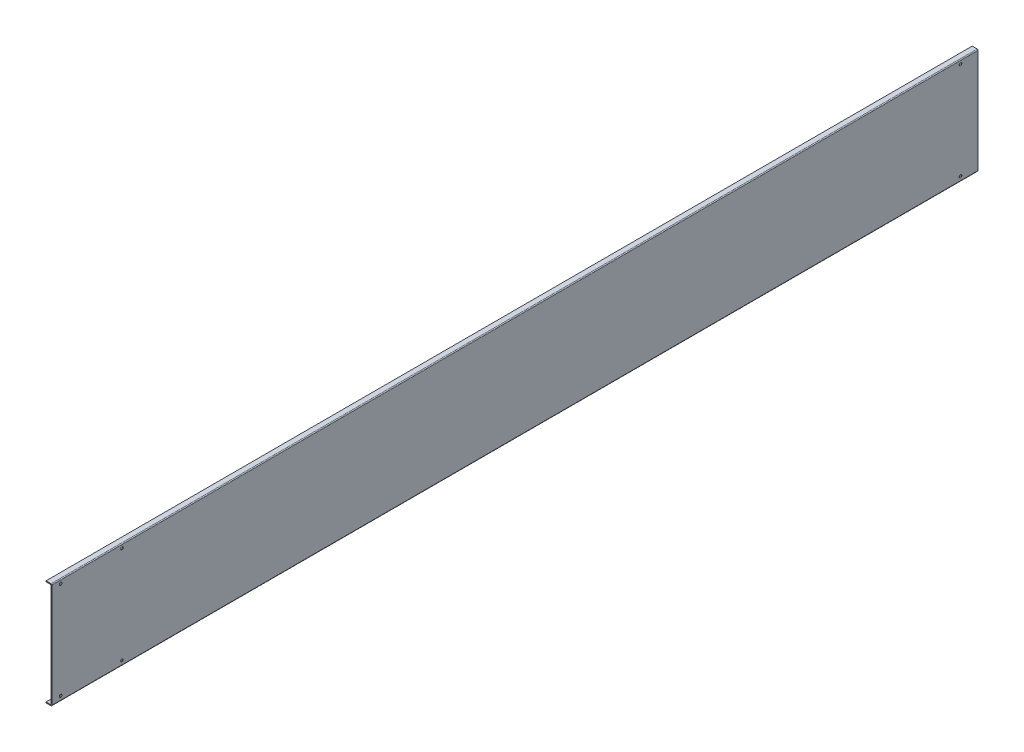
ISO-10303-21;
HEADER;
FILE_DESCRIPTION(('STEP AP214'),'2;1');
FILE_NAME('part.step','',(''),(''),'','','');
FILE_SCHEMA(('AUTOMOTIVE_DESIGN { 1 0 10303 214 1 1 1 1 }'));
ENDSEC;
DATA;
#1=APPLICATION_CONTEXT('core data for automotive mechanical design processes');
#2=APPLICATION_PROTOCOL_DEFINITION('international standard','automotive_design',2000,#1);
#3=PRODUCT_CONTEXT('',#1,'mechanical');
#4=PRODUCT('Part','Part','',(#3));
#5=PRODUCT_RELATED_PRODUCT_CATEGORY('part','',(#4));
#6=PRODUCT_DEFINITION_FORMATION('','',#4);
#7=PRODUCT_DEFINITION_CONTEXT('part definition',#1,'design');
#8=PRODUCT_DEFINITION('design','',#6,#7);
#9=PRODUCT_DEFINITION_SHAPE('','',#8);
#10=(LENGTH_UNIT() NAMED_UNIT(*) SI_UNIT(.MILLI.,.METRE.));
#11=(NAMED_UNIT(*) PLANE_ANGLE_UNIT() SI_UNIT($,.RADIAN.));
#12=(NAMED_UNIT(*) SI_UNIT($,.STERADIAN.) SOLID_ANGLE_UNIT());
#13=UNCERTAINTY_MEASURE_WITH_UNIT(LENGTH_MEASURE(1.E-05),#10,'distance_accuracy_value','');
#14=(GEOMETRIC_REPRESENTATION_CONTEXT(3) GLOBAL_UNCERTAINTY_ASSIGNED_CONTEXT((#13)) GLOBAL_UNIT_ASSIGNED_CONTEXT((#10,
#11,#12)) REPRESENTATION_CONTEXT('',''));
#15=CARTESIAN_POINT('',(0.,0.,0.));
#16=DIRECTION('',(0.,0.,1.));
#17=DIRECTION('',(1.,0.,0.));
#18=AXIS2_PLACEMENT_3D('',#15,#16,#17);
#19=CARTESIAN_POINT('',(0.,-181.,-1585.));
#20=DIRECTION('',(1.,0.,0.));
#21=DIRECTION('',(0.,0.,-1.));
#22=AXIS2_PLACEMENT_3D('',#19,#20,#21);
#23=PLANE('',#22);
#24=CARTESIAN_POINT('',(0.,-173.,-120.));
#25=DIRECTION('',(1.,0.,0.));
#26=DIRECTION('',(0.,0.,-1.));
#27=AXIS2_PLACEMENT_3D('',#24,#25,#26);
#28=CIRCLE('',#27,2.25);
#29=CARTESIAN_POINT('',(0.,-173.,-122.25));
#30=VERTEX_POINT('',#29);
#31=EDGE_CURVE('E275',#30,#30,#28,.T.);
#32=ORIENTED_EDGE('',*,*,#31,.F.);
#33=EDGE_LOOP('',(#32));
#34=FACE_BOUND('',#33,.T.);
#35=CARTESIAN_POINT('',(0.,-173.,-1555.));
#36=DIRECTION('',(1.,0.,0.));
#37=DIRECTION('',(0.,0.,-1.));
#38=AXIS2_PLACEMENT_3D('',#35,#36,#37);
#39=CIRCLE('',#38,2.25);
#40=CARTESIAN_POINT('',(0.,-173.,-1557.25));
#41=VERTEX_POINT('',#40);
#42=EDGE_CURVE('E280',#41,#41,#39,.T.);
#43=ORIENTED_EDGE('',*,*,#42,.F.);
#44=EDGE_LOOP('',(#43));
#45=FACE_BOUND('',#44,.T.);
#46=CARTESIAN_POINT('',(0.,-173.,-15.));
#47=DIRECTION('',(1.,0.,0.));
#48=DIRECTION('',(0.,0.,-1.));
#49=AXIS2_PLACEMENT_3D('',#46,#47,#48);
#50=CIRCLE('',#49,2.25);
#51=CARTESIAN_POINT('',(0.,-173.,-17.25));
#52=VERTEX_POINT('',#51);
#53=EDGE_CURVE('E289',#52,#52,#50,.T.);
#54=ORIENTED_EDGE('',*,*,#53,.F.);
#55=EDGE_LOOP('',(#54));
#56=FACE_BOUND('',#55,.T.);
#57=CARTESIAN_POINT('',(0.,-7.,-15.));
#58=DIRECTION('',(1.,0.,0.));
#59=DIRECTION('',(0.,0.,-1.));
#60=AXIS2_PLACEMENT_3D('',#57,#58,#59);
#61=CIRCLE('',#60,2.25);
#62=CARTESIAN_POINT('',(0.,-7.,-17.25));
#63=VERTEX_POINT('',#62);
#64=EDGE_CURVE('E295',#63,#63,#61,.T.);
#65=ORIENTED_EDGE('',*,*,#64,.F.);
#66=EDGE_LOOP('',(#65));
#67=FACE_BOUND('',#66,.T.);
#68=CARTESIAN_POINT('',(0.,-7.,-120.));
#69=DIRECTION('',(1.,0.,0.));
#70=DIRECTION('',(0.,0.,-1.));
#71=AXIS2_PLACEMENT_3D('',#68,#69,#70);
#72=CIRCLE('',#71,2.25);
#73=CARTESIAN_POINT('',(0.,-7.,-122.25));
#74=VERTEX_POINT('',#73);
#75=EDGE_CURVE('E301',#74,#74,#72,.T.);
#76=ORIENTED_EDGE('',*,*,#75,.F.);
#77=EDGE_LOOP('',(#76));
#78=FACE_BOUND('',#77,.T.);
#79=CARTESIAN_POINT('',(0.,-7.,-1555.));
#80=DIRECTION('',(1.,0.,0.));
#81=DIRECTION('',(0.,0.,-1.));
#82=AXIS2_PLACEMENT_3D('',#79,#80,#81);
#83=CIRCLE('',#82,2.25);
#84=CARTESIAN_POINT('',(0.,-7.,-1557.25));
#85=VERTEX_POINT('',#84);
#86=EDGE_CURVE('E307',#85,#85,#83,.T.);
#87=ORIENTED_EDGE('',*,*,#86,.F.);
#88=EDGE_LOOP('',(#87));
#89=FACE_BOUND('',#88,.T.);
#90=DIRECTION('',(0.,1.,0.));
#91=VECTOR('',#90,1.);
#92=CARTESIAN_POINT('',(0.,-181.,0.));
#93=LINE('',#92,#91);
#94=CARTESIAN_POINT('',(0.,-179.5,0.));
#95=VERTEX_POINT('',#94);
#96=CARTESIAN_POINT('',(0.,-1.50000000000003,0.));
#97=VERTEX_POINT('',#96);
#98=EDGE_CURVE('E148',#95,#97,#93,.T.);
#99=ORIENTED_EDGE('',*,*,#98,.F.);
#100=DIRECTION('',(0.,0.,1.));
#101=VECTOR('',#100,1.);
#102=CARTESIAN_POINT('',(0.,-179.5,-1585.));
#103=LINE('',#102,#101);
#104=CARTESIAN_POINT('',(0.,-179.5,-1585.));
#105=VERTEX_POINT('',#104);
#106=EDGE_CURVE('E189',#95,#105,#103,.F.);
#107=ORIENTED_EDGE('',*,*,#106,.T.);
#108=DIRECTION('',(0.,1.,0.));
#109=VECTOR('',#108,1.);
#110=CARTESIAN_POINT('',(0.,-181.,-1585.));
#111=LINE('',#110,#109);
#112=CARTESIAN_POINT('',(0.,-1.50000000000003,-1585.));
#113=VERTEX_POINT('',#112);
#114=EDGE_CURVE('E118',#105,#113,#111,.T.);
#115=ORIENTED_EDGE('',*,*,#114,.T.);
#116=DIRECTION('',(0.,0.,1.));
#117=VECTOR('',#116,1.);
#118=CARTESIAN_POINT('',(0.,-1.50000000000003,-1585.));
#119=LINE('',#118,#117);
#120=EDGE_CURVE('E186',#113,#97,#119,.T.);
#121=ORIENTED_EDGE('',*,*,#120,.T.);
#122=EDGE_LOOP('',(#99,#107,#115,#121));
#123=FACE_BOUND('',#122,.T.);
#124=ADVANCED_FACE('F36',(#34,#45,#56,#67,#78,#89,#123),#23,.T.);
#125=CARTESIAN_POINT('',(0.,-181.,-1585.));
#126=DIRECTION('',(0.,-1.,0.));
#127=DIRECTION('',(0.,0.,-1.));
#128=AXIS2_PLACEMENT_3D('',#125,#126,#127);
#129=PLANE('',#128);
#130=DIRECTION('',(1.,0.,0.));
#131=VECTOR('',#130,1.);
#132=CARTESIAN_POINT('',(0.,-181.,-1585.));
#133=LINE('',#132,#131);
#134=CARTESIAN_POINT('',(-10.,-181.,-1585.));
#135=VERTEX_POINT('',#134);
#136=CARTESIAN_POINT('',(-1.5,-181.,-1585.));
#137=VERTEX_POINT('',#136);
#138=EDGE_CURVE('E126',#135,#137,#133,.T.);
#139=ORIENTED_EDGE('',*,*,#138,.T.);
#140=DIRECTION('',(0.,0.,1.));
#141=VECTOR('',#140,1.);
#142=CARTESIAN_POINT('',(-1.5,-181.,-1585.));
#143=LINE('',#142,#141);
#144=CARTESIAN_POINT('',(-1.5,-181.,0.));
#145=VERTEX_POINT('',#144);
#146=EDGE_CURVE('E172',#137,#145,#143,.T.);
#147=ORIENTED_EDGE('',*,*,#146,.T.);
#148=DIRECTION('',(1.,0.,0.));
#149=VECTOR('',#148,1.);
#150=CARTESIAN_POINT('',(0.,-181.,0.));
#151=LINE('',#150,#149);
#152=CARTESIAN_POINT('',(-10.,-181.,0.));
#153=VERTEX_POINT('',#152);
#154=EDGE_CURVE('E167',#153,#145,#151,.T.);
#155=ORIENTED_EDGE('',*,*,#154,.F.);
#156=DIRECTION('',(0.,0.,1.));
#157=VECTOR('',#156,1.);
#158=CARTESIAN_POINT('',(-10.,-181.,-1585.));
#159=LINE('',#158,#157);
#160=EDGE_CURVE('E170',#135,#153,#159,.T.);
#161=ORIENTED_EDGE('',*,*,#160,.F.);
#162=EDGE_LOOP('',(#139,#147,#155,#161));
#163=FACE_BOUND('',#162,.T.);
#164=ADVANCED_FACE('F198',(#163),#129,.T.);
#165=CARTESIAN_POINT('',(-10.,-181.,-1585.));
#166=DIRECTION('',(-1.,0.,0.));
#167=DIRECTION('',(0.,0.,1.));
#168=AXIS2_PLACEMENT_3D('',#165,#166,#167);
#169=PLANE('',#168);
#170=DIRECTION('',(0.,-1.,0.));
#171=VECTOR('',#170,1.);
#172=CARTESIAN_POINT('',(-10.,-181.,0.));
#173=LINE('',#172,#171);
#174=CARTESIAN_POINT('',(-10.,-179.5,0.));
#175=VERTEX_POINT('',#174);
#176=EDGE_CURVE('E164',#175,#153,#173,.T.);
#177=ORIENTED_EDGE('',*,*,#176,.F.);
#178=DIRECTION('',(0.,0.,1.));
#179=VECTOR('',#178,1.);
#180=CARTESIAN_POINT('',(-10.,-179.5,-1585.));
#181=LINE('',#180,#179);
#182=CARTESIAN_POINT('',(-10.,-179.5,-1585.));
#183=VERTEX_POINT('',#182);
#184=EDGE_CURVE('E173',#183,#175,#181,.T.);
#185=ORIENTED_EDGE('',*,*,#184,.F.);
#186=DIRECTION('',(0.,-1.,0.));
#187=VECTOR('',#186,1.);
#188=CARTESIAN_POINT('',(-10.,-181.,-1585.));
#189=LINE('',#188,#187);
#190=EDGE_CURVE('E143',#183,#135,#189,.T.);
#191=ORIENTED_EDGE('',*,*,#190,.T.);
#192=ORIENTED_EDGE('',*,*,#160,.T.);
#193=EDGE_LOOP('',(#177,#185,#191,#192));
#194=FACE_BOUND('',#193,.T.);
#195=ADVANCED_FACE('F219',(#194),#169,.T.);
#196=CARTESIAN_POINT('',(-1.5,-179.5,-1585.));
#197=DIRECTION('',(0.,1.,0.));
#198=DIRECTION('',(0.,0.,1.));
#199=AXIS2_PLACEMENT_3D('',#196,#197,#198);
#200=PLANE('',#199);
#201=DIRECTION('',(-1.,0.,0.));
#202=VECTOR('',#201,1.);
#203=CARTESIAN_POINT('',(-1.5,-179.5,0.));
#204=LINE('',#203,#202);
#205=CARTESIAN_POINT('',(-1.5,-179.5,0.));
#206=VERTEX_POINT('',#205);
#207=EDGE_CURVE('E161',#206,#175,#204,.T.);
#208=ORIENTED_EDGE('',*,*,#207,.F.);
#209=DIRECTION('',(0.,0.,1.));
#210=VECTOR('',#209,1.);
#211=CARTESIAN_POINT('',(-1.5,-179.5,-1585.));
#212=LINE('',#211,#210);
#213=CARTESIAN_POINT('',(-1.5,-179.5,-1585.));
#214=VERTEX_POINT('',#213);
#215=EDGE_CURVE('E175',#214,#206,#212,.T.);
#216=ORIENTED_EDGE('',*,*,#215,.F.);
#217=DIRECTION('',(-1.,0.,0.));
#218=VECTOR('',#217,1.);
#219=CARTESIAN_POINT('',(-1.5,-179.5,-1585.));
#220=LINE('',#219,#218);
#221=EDGE_CURVE('E140',#214,#183,#220,.T.);
#222=ORIENTED_EDGE('',*,*,#221,.T.);
#223=ORIENTED_EDGE('',*,*,#184,.T.);
#224=EDGE_LOOP('',(#208,#216,#222,#223));
#225=FACE_BOUND('',#224,.T.);
#226=ADVANCED_FACE('F216',(#225),#200,.T.);
#227=CARTESIAN_POINT('',(-1.5,-179.5,-1585.));
#228=DIRECTION('',(-1.,0.,0.));
#229=DIRECTION('',(0.,-1.,0.));
#230=AXIS2_PLACEMENT_3D('',#227,#228,#229);
#231=PLANE('',#230);
#232=CARTESIAN_POINT('',(-1.5,-173.,-120.));
#233=DIRECTION('',(-1.,0.,0.));
#234=DIRECTION('',(0.,-1.,0.));
#235=AXIS2_PLACEMENT_3D('',#232,#233,#234);
#236=CIRCLE('',#235,2.25);
#237=CARTESIAN_POINT('',(-1.5,-175.25,-120.));
#238=VERTEX_POINT('',#237);
#239=EDGE_CURVE('E278',#238,#238,#236,.T.);
#240=ORIENTED_EDGE('',*,*,#239,.F.);
#241=EDGE_LOOP('',(#240));
#242=FACE_BOUND('',#241,.T.);
#243=CARTESIAN_POINT('',(-1.5,-173.,-1555.));
#244=DIRECTION('',(-1.,0.,0.));
#245=DIRECTION('',(0.,-1.,0.));
#246=AXIS2_PLACEMENT_3D('',#243,#244,#245);
#247=CIRCLE('',#246,2.25);
#248=CARTESIAN_POINT('',(-1.5,-175.25,-1555.));
#249=VERTEX_POINT('',#248);
#250=EDGE_CURVE('E283',#249,#249,#247,.T.);
#251=ORIENTED_EDGE('',*,*,#250,.F.);
#252=EDGE_LOOP('',(#251));
#253=FACE_BOUND('',#252,.T.);
#254=CARTESIAN_POINT('',(-1.5,-173.,-15.));
#255=DIRECTION('',(-1.,0.,0.));
#256=DIRECTION('',(0.,-1.,0.));
#257=AXIS2_PLACEMENT_3D('',#254,#255,#256);
#258=CIRCLE('',#257,2.25);
#259=CARTESIAN_POINT('',(-1.5,-175.25,-15.));
#260=VERTEX_POINT('',#259);
#261=EDGE_CURVE('E292',#260,#260,#258,.T.);
#262=ORIENTED_EDGE('',*,*,#261,.F.);
#263=EDGE_LOOP('',(#262));
#264=FACE_BOUND('',#263,.T.);
#265=CARTESIAN_POINT('',(-1.5,-7.,-15.));
#266=DIRECTION('',(-1.,0.,0.));
#267=DIRECTION('',(0.,-1.,0.));
#268=AXIS2_PLACEMENT_3D('',#265,#266,#267);
#269=CIRCLE('',#268,2.25);
#270=CARTESIAN_POINT('',(-1.5,-9.25,-15.));
#271=VERTEX_POINT('',#270);
#272=EDGE_CURVE('E298',#271,#271,#269,.T.);
#273=ORIENTED_EDGE('',*,*,#272,.F.);
#274=EDGE_LOOP('',(#273));
#275=FACE_BOUND('',#274,.T.);
#276=CARTESIAN_POINT('',(-1.5,-7.,-120.));
#277=DIRECTION('',(-1.,0.,0.));
#278=DIRECTION('',(0.,-1.,0.));
#279=AXIS2_PLACEMENT_3D('',#276,#277,#278);
#280=CIRCLE('',#279,2.25);
#281=CARTESIAN_POINT('',(-1.5,-9.25,-120.));
#282=VERTEX_POINT('',#281);
#283=EDGE_CURVE('E304',#282,#282,#280,.T.);
#284=ORIENTED_EDGE('',*,*,#283,.F.);
#285=EDGE_LOOP('',(#284));
#286=FACE_BOUND('',#285,.T.);
#287=CARTESIAN_POINT('',(-1.5,-7.,-1555.));
#288=DIRECTION('',(-1.,0.,0.));
#289=DIRECTION('',(0.,-1.,0.));
#290=AXIS2_PLACEMENT_3D('',#287,#288,#289);
#291=CIRCLE('',#290,2.25);
#292=CARTESIAN_POINT('',(-1.5,-9.25,-1555.));
#293=VERTEX_POINT('',#292);
#294=EDGE_CURVE('E152',#293,#293,#291,.T.);
#295=ORIENTED_EDGE('',*,*,#294,.F.);
#296=EDGE_LOOP('',(#295));
#297=FACE_BOUND('',#296,.T.);
#298=DIRECTION('',(0.,-1.,0.));
#299=VECTOR('',#298,1.);
#300=CARTESIAN_POINT('',(-1.5,-179.5,0.));
#301=LINE('',#300,#299);
#302=CARTESIAN_POINT('',(-1.5,-1.5,0.));
#303=VERTEX_POINT('',#302);
#304=EDGE_CURVE('E158',#303,#206,#301,.T.);
#305=ORIENTED_EDGE('',*,*,#304,.F.);
#306=DIRECTION('',(0.,0.,1.));
#307=VECTOR('',#306,1.);
#308=CARTESIAN_POINT('',(-1.5,-1.5,-1585.));
#309=LINE('',#308,#307);
#310=CARTESIAN_POINT('',(-1.5,-1.5,-1585.));
#311=VERTEX_POINT('',#310);
#312=EDGE_CURVE('E177',#311,#303,#309,.T.);
#313=ORIENTED_EDGE('',*,*,#312,.F.);
#314=DIRECTION('',(0.,-1.,0.));
#315=VECTOR('',#314,1.);
#316=CARTESIAN_POINT('',(-1.5,-179.5,-1585.));
#317=LINE('',#316,#315);
#318=EDGE_CURVE('E134',#311,#214,#317,.T.);
#319=ORIENTED_EDGE('',*,*,#318,.T.);
#320=ORIENTED_EDGE('',*,*,#215,.T.);
#321=EDGE_LOOP('',(#305,#313,#319,#320));
#322=FACE_BOUND('',#321,.T.);
#323=ADVANCED_FACE('F212',(#242,#253,#264,#275,#286,#297,#322),#231,.T.);
#324=CARTESIAN_POINT('',(-1.5,-1.5,-1585.));
#325=DIRECTION('',(0.,-1.,0.));
#326=DIRECTION('',(0.,0.,-1.));
#327=AXIS2_PLACEMENT_3D('',#324,#325,#326);
#328=PLANE('',#327);
#329=DIRECTION('',(1.,0.,0.));
#330=VECTOR('',#329,1.);
#331=CARTESIAN_POINT('',(-1.5,-1.5,0.));
#332=LINE('',#331,#330);
#333=CARTESIAN_POINT('',(-10.,-1.5,0.));
#334=VERTEX_POINT('',#333);
#335=EDGE_CURVE('E155',#334,#303,#332,.T.);
#336=ORIENTED_EDGE('',*,*,#335,.F.);
#337=DIRECTION('',(0.,0.,1.));
#338=VECTOR('',#337,1.);
#339=CARTESIAN_POINT('',(-10.,-1.5,-1585.));
#340=LINE('',#339,#338);
#341=CARTESIAN_POINT('',(-10.,-1.5,-1585.));
#342=VERTEX_POINT('',#341);
#343=EDGE_CURVE('E125',#342,#334,#340,.T.);
#344=ORIENTED_EDGE('',*,*,#343,.F.);
#345=DIRECTION('',(1.,0.,0.));
#346=VECTOR('',#345,1.);
#347=CARTESIAN_POINT('',(-1.5,-1.5,-1585.));
#348=LINE('',#347,#346);
#349=EDGE_CURVE('E132',#342,#311,#348,.T.);
#350=ORIENTED_EDGE('',*,*,#349,.T.);
#351=ORIENTED_EDGE('',*,*,#312,.T.);
#352=EDGE_LOOP('',(#336,#344,#350,#351));
#353=FACE_BOUND('',#352,.T.);
#354=ADVANCED_FACE('F210',(#353),#328,.T.);
#355=CARTESIAN_POINT('',(-10.,-1.5,-1585.));
#356=DIRECTION('',(-1.,0.,0.));
#357=DIRECTION('',(0.,-1.,0.));
#358=AXIS2_PLACEMENT_3D('',#355,#356,#357);
#359=PLANE('',#358);
#360=DIRECTION('',(0.,-1.,0.));
#361=VECTOR('',#360,1.);
#362=CARTESIAN_POINT('',(-10.,-1.5,0.));
#363=LINE('',#362,#361);
#364=CARTESIAN_POINT('',(-10.,0.,0.));
#365=VERTEX_POINT('',#364);
#366=EDGE_CURVE('E124',#365,#334,#363,.T.);
#367=ORIENTED_EDGE('',*,*,#366,.F.);
#368=DIRECTION('',(0.,0.,1.));
#369=VECTOR('',#368,1.);
#370=CARTESIAN_POINT('',(-10.,0.,-1585.));
#371=LINE('',#370,#369);
#372=CARTESIAN_POINT('',(-10.,0.,-1585.));
#373=VERTEX_POINT('',#372);
#374=EDGE_CURVE('E114',#373,#365,#371,.T.);
#375=ORIENTED_EDGE('',*,*,#374,.F.);
#376=DIRECTION('',(0.,-1.,0.));
#377=VECTOR('',#376,1.);
#378=CARTESIAN_POINT('',(-10.,-1.5,-1585.));
#379=LINE('',#378,#377);
#380=EDGE_CURVE('E117',#373,#342,#379,.T.);
#381=ORIENTED_EDGE('',*,*,#380,.T.);
#382=ORIENTED_EDGE('',*,*,#343,.T.);
#383=EDGE_LOOP('',(#367,#375,#381,#382));
#384=FACE_BOUND('',#383,.T.);
#385=ADVANCED_FACE('F122',(#384),#359,.T.);
#386=CARTESIAN_POINT('',(0.,0.,-1585.));
#387=DIRECTION('',(0.,1.,0.));
#388=DIRECTION('',(0.,0.,1.));
#389=AXIS2_PLACEMENT_3D('',#386,#387,#388);
#390=PLANE('',#389);
#391=DIRECTION('',(-1.,0.,0.));
#392=VECTOR('',#391,1.);
#393=CARTESIAN_POINT('',(0.,0.,0.));
#394=LINE('',#393,#392);
#395=CARTESIAN_POINT('',(-1.5,0.,0.));
#396=VERTEX_POINT('',#395);
#397=EDGE_CURVE('E151',#396,#365,#394,.T.);
#398=ORIENTED_EDGE('',*,*,#397,.F.);
#399=DIRECTION('',(0.,0.,1.));
#400=VECTOR('',#399,1.);
#401=CARTESIAN_POINT('',(-1.5,0.,-1585.));
#402=LINE('',#401,#400);
#403=CARTESIAN_POINT('',(-1.5,0.,-1585.));
#404=VERTEX_POINT('',#403);
#405=EDGE_CURVE('E11',#396,#404,#402,.F.);
#406=ORIENTED_EDGE('',*,*,#405,.T.);
#407=DIRECTION('',(-1.,0.,0.));
#408=VECTOR('',#407,1.);
#409=CARTESIAN_POINT('',(0.,0.,-1585.));
#410=LINE('',#409,#408);
#411=EDGE_CURVE('E111',#404,#373,#410,.T.);
#412=ORIENTED_EDGE('',*,*,#411,.T.);
#413=ORIENTED_EDGE('',*,*,#374,.T.);
#414=EDGE_LOOP('',(#398,#406,#412,#413));
#415=FACE_BOUND('',#414,.T.);
#416=ADVANCED_FACE('F113',(#415),#390,.T.);
#417=CARTESIAN_POINT('',(0.,0.,-1585.));
#418=DIRECTION('',(0.,0.,1.));
#419=DIRECTION('',(1.,0.,0.));
#420=AXIS2_PLACEMENT_3D('',#417,#418,#419);
#421=PLANE('',#420);
#422=ORIENTED_EDGE('',*,*,#114,.F.);
#423=CARTESIAN_POINT('',(-1.5,-179.5,-1585.));
#424=DIRECTION('',(0.,0.,1.));
#425=DIRECTION('',(1.,0.,0.));
#426=AXIS2_PLACEMENT_3D('',#423,#424,#425);
#427=CIRCLE('',#426,1.5);
#428=EDGE_CURVE('E44',#105,#137,#427,.F.);
#429=ORIENTED_EDGE('',*,*,#428,.T.);
#430=ORIENTED_EDGE('',*,*,#138,.F.);
#431=ORIENTED_EDGE('',*,*,#190,.F.);
#432=ORIENTED_EDGE('',*,*,#221,.F.);
#433=ORIENTED_EDGE('',*,*,#318,.F.);
#434=ORIENTED_EDGE('',*,*,#349,.F.);
#435=ORIENTED_EDGE('',*,*,#380,.F.);
#436=ORIENTED_EDGE('',*,*,#411,.F.);
#437=CARTESIAN_POINT('',(-1.5,-1.50000000000003,-1585.));
#438=DIRECTION('',(0.,0.,1.));
#439=DIRECTION('',(1.,0.,0.));
#440=AXIS2_PLACEMENT_3D('',#437,#438,#439);
#441=CIRCLE('',#440,1.5);
#442=EDGE_CURVE('E56',#404,#113,#441,.F.);
#443=ORIENTED_EDGE('',*,*,#442,.T.);
#444=EDGE_LOOP('',(#422,#429,#430,#431,#432,#433,#434,#435,#436,#443));
#445=FACE_BOUND('',#444,.T.);
#446=ADVANCED_FACE('F129',(#445),#421,.F.);
#447=CARTESIAN_POINT('',(0.,0.,0.));
#448=DIRECTION('',(0.,0.,1.));
#449=DIRECTION('',(1.,0.,0.));
#450=AXIS2_PLACEMENT_3D('',#447,#448,#449);
#451=PLANE('',#450);
#452=ORIENTED_EDGE('',*,*,#154,.T.);
#453=CARTESIAN_POINT('',(-1.5,-179.5,0.));
#454=DIRECTION('',(0.,0.,1.));
#455=DIRECTION('',(1.,0.,0.));
#456=AXIS2_PLACEMENT_3D('',#453,#454,#455);
#457=CIRCLE('',#456,1.5);
#458=EDGE_CURVE('E184',#145,#95,#457,.T.);
#459=ORIENTED_EDGE('',*,*,#458,.T.);
#460=ORIENTED_EDGE('',*,*,#98,.T.);
#461=CARTESIAN_POINT('',(-1.5,-1.50000000000003,0.));
#462=DIRECTION('',(0.,0.,1.));
#463=DIRECTION('',(1.,0.,0.));
#464=AXIS2_PLACEMENT_3D('',#461,#462,#463);
#465=CIRCLE('',#464,1.5);
#466=EDGE_CURVE('E182',#97,#396,#465,.T.);
#467=ORIENTED_EDGE('',*,*,#466,.T.);
#468=ORIENTED_EDGE('',*,*,#397,.T.);
#469=ORIENTED_EDGE('',*,*,#366,.T.);
#470=ORIENTED_EDGE('',*,*,#335,.T.);
#471=ORIENTED_EDGE('',*,*,#304,.T.);
#472=ORIENTED_EDGE('',*,*,#207,.T.);
#473=ORIENTED_EDGE('',*,*,#176,.T.);
#474=EDGE_LOOP('',(#452,#459,#460,#467,#468,#469,#470,#471,#472,#473));
#475=FACE_BOUND('',#474,.T.);
#476=ADVANCED_FACE('F203',(#475),#451,.T.);
#477=CARTESIAN_POINT('',(-1.5,-179.5,-1585.));
#478=DIRECTION('',(0.,0.,1.));
#479=DIRECTION('',(1.,0.,0.));
#480=AXIS2_PLACEMENT_3D('',#477,#478,#479);
#481=CYLINDRICAL_SURFACE('',#480,1.5);
#482=ORIENTED_EDGE('',*,*,#428,.F.);
#483=ORIENTED_EDGE('',*,*,#106,.F.);
#484=ORIENTED_EDGE('',*,*,#458,.F.);
#485=ORIENTED_EDGE('',*,*,#146,.F.);
#486=EDGE_LOOP('',(#482,#483,#484,#485));
#487=FACE_BOUND('',#486,.T.);
#488=ADVANCED_FACE('F200',(#487),#481,.T.);
#489=CARTESIAN_POINT('',(-1.5,-1.50000000000003,-1585.));
#490=DIRECTION('',(0.,0.,1.));
#491=DIRECTION('',(1.,0.,0.));
#492=AXIS2_PLACEMENT_3D('',#489,#490,#491);
#493=CYLINDRICAL_SURFACE('',#492,1.5);
#494=ORIENTED_EDGE('',*,*,#442,.F.);
#495=ORIENTED_EDGE('',*,*,#405,.F.);
#496=ORIENTED_EDGE('',*,*,#466,.F.);
#497=ORIENTED_EDGE('',*,*,#120,.F.);
#498=EDGE_LOOP('',(#494,#495,#496,#497));
#499=FACE_BOUND('',#498,.T.);
#500=ADVANCED_FACE('F38',(#499),#493,.T.);
#501=CARTESIAN_POINT('',(0.,-7.,-1555.));
#502=DIRECTION('',(1.,0.,0.));
#503=DIRECTION('',(0.,0.,-1.));
#504=AXIS2_PLACEMENT_3D('',#501,#502,#503);
#505=CYLINDRICAL_SURFACE('',#504,2.25);
#506=ORIENTED_EDGE('',*,*,#86,.T.);
#507=EDGE_LOOP('',(#506));
#508=FACE_BOUND('',#507,.T.);
#509=ORIENTED_EDGE('',*,*,#294,.T.);
#510=EDGE_LOOP('',(#509));
#511=FACE_BOUND('',#510,.T.);
#512=ADVANCED_FACE('F242',(#508,#511),#505,.F.);
#513=CARTESIAN_POINT('',(0.,-7.,-120.));
#514=DIRECTION('',(1.,0.,0.));
#515=DIRECTION('',(0.,0.,-1.));
#516=AXIS2_PLACEMENT_3D('',#513,#514,#515);
#517=CYLINDRICAL_SURFACE('',#516,2.25);
#518=ORIENTED_EDGE('',*,*,#75,.T.);
#519=EDGE_LOOP('',(#518));
#520=FACE_BOUND('',#519,.T.);
#521=ORIENTED_EDGE('',*,*,#283,.T.);
#522=EDGE_LOOP('',(#521));
#523=FACE_BOUND('',#522,.T.);
#524=ADVANCED_FACE('F251',(#520,#523),#517,.F.);
#525=CARTESIAN_POINT('',(0.,-7.,-15.));
#526=DIRECTION('',(1.,0.,0.));
#527=DIRECTION('',(0.,0.,-1.));
#528=AXIS2_PLACEMENT_3D('',#525,#526,#527);
#529=CYLINDRICAL_SURFACE('',#528,2.25);
#530=ORIENTED_EDGE('',*,*,#64,.T.);
#531=EDGE_LOOP('',(#530));
#532=FACE_BOUND('',#531,.T.);
#533=ORIENTED_EDGE('',*,*,#272,.T.);
#534=EDGE_LOOP('',(#533));
#535=FACE_BOUND('',#534,.T.);
#536=ADVANCED_FACE('F255',(#532,#535),#529,.F.);
#537=CARTESIAN_POINT('',(0.,-173.,-15.));
#538=DIRECTION('',(1.,0.,0.));
#539=DIRECTION('',(0.,0.,-1.));
#540=AXIS2_PLACEMENT_3D('',#537,#538,#539);
#541=CYLINDRICAL_SURFACE('',#540,2.25);
#542=ORIENTED_EDGE('',*,*,#53,.T.);
#543=EDGE_LOOP('',(#542));
#544=FACE_BOUND('',#543,.T.);
#545=ORIENTED_EDGE('',*,*,#261,.T.);
#546=EDGE_LOOP('',(#545));
#547=FACE_BOUND('',#546,.T.);
#548=ADVANCED_FACE('F259',(#544,#547),#541,.F.);
#549=CARTESIAN_POINT('',(0.,-173.,-1555.));
#550=DIRECTION('',(1.,0.,0.));
#551=DIRECTION('',(0.,0.,-1.));
#552=AXIS2_PLACEMENT_3D('',#549,#550,#551);
#553=CYLINDRICAL_SURFACE('',#552,2.25);
#554=ORIENTED_EDGE('',*,*,#42,.T.);
#555=EDGE_LOOP('',(#554));
#556=FACE_BOUND('',#555,.T.);
#557=ORIENTED_EDGE('',*,*,#250,.T.);
#558=EDGE_LOOP('',(#557));
#559=FACE_BOUND('',#558,.T.);
#560=ADVANCED_FACE('F263',(#556,#559),#553,.F.);
#561=CARTESIAN_POINT('',(0.,-173.,-120.));
#562=DIRECTION('',(1.,0.,0.));
#563=DIRECTION('',(0.,0.,-1.));
#564=AXIS2_PLACEMENT_3D('',#561,#562,#563);
#565=CYLINDRICAL_SURFACE('',#564,2.25);
#566=ORIENTED_EDGE('',*,*,#31,.T.);
#567=EDGE_LOOP('',(#566));
#568=FACE_BOUND('',#567,.T.);
#569=ORIENTED_EDGE('',*,*,#239,.T.);
#570=EDGE_LOOP('',(#569));
#571=FACE_BOUND('',#570,.T.);
#572=ADVANCED_FACE('F267',(#568,#571),#565,.F.);
#573=CLOSED_SHELL('',(#124,#164,#195,#226,#323,#354,#385,#416,#446,#476,#488,#500,#512,#524,
#536,#548,#560,#572));
#574=MANIFOLD_SOLID_BREP('B2',#573);
#575=ADVANCED_BREP_SHAPE_REPRESENTATION('',(#18,#574),#14);
#576=SHAPE_DEFINITION_REPRESENTATION(#9,#575);
ENDSEC;
END-ISO-10303-21;
